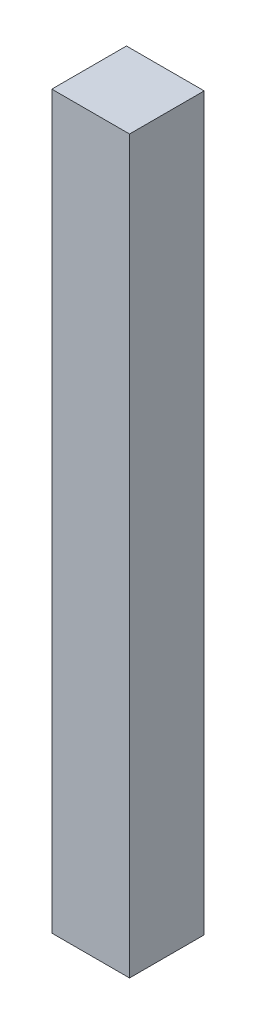
ISO-10303-21;
HEADER;
FILE_DESCRIPTION(('STEP AP214'),'2;1');
FILE_NAME('part.step','',(''),(''),'','','');
FILE_SCHEMA(('AUTOMOTIVE_DESIGN { 1 0 10303 214 1 1 1 1 }'));
ENDSEC;
DATA;
#1=APPLICATION_CONTEXT('core data for automotive mechanical design processes');
#2=APPLICATION_PROTOCOL_DEFINITION('international standard','automotive_design',2000,#1);
#3=PRODUCT_CONTEXT('',#1,'mechanical');
#4=PRODUCT('Part','Part','',(#3));
#5=PRODUCT_RELATED_PRODUCT_CATEGORY('part','',(#4));
#6=PRODUCT_DEFINITION_FORMATION('','',#4);
#7=PRODUCT_DEFINITION_CONTEXT('part definition',#1,'design');
#8=PRODUCT_DEFINITION('design','',#6,#7);
#9=PRODUCT_DEFINITION_SHAPE('','',#8);
#10=(LENGTH_UNIT() NAMED_UNIT(*) SI_UNIT(.MILLI.,.METRE.));
#11=(NAMED_UNIT(*) PLANE_ANGLE_UNIT() SI_UNIT($,.RADIAN.));
#12=(NAMED_UNIT(*) SI_UNIT($,.STERADIAN.) SOLID_ANGLE_UNIT());
#13=UNCERTAINTY_MEASURE_WITH_UNIT(LENGTH_MEASURE(1.E-05),#10,'distance_accuracy_value','');
#14=(GEOMETRIC_REPRESENTATION_CONTEXT(3) GLOBAL_UNCERTAINTY_ASSIGNED_CONTEXT((#13)) GLOBAL_UNIT_ASSIGNED_CONTEXT((#10,
#11,#12)) REPRESENTATION_CONTEXT('',''));
#15=CARTESIAN_POINT('',(0.,0.,0.));
#16=DIRECTION('',(0.,0.,1.));
#17=DIRECTION('',(1.,0.,0.));
#18=AXIS2_PLACEMENT_3D('',#15,#16,#17);
#19=CARTESIAN_POINT('',(0.122024776809807,0.,-0.1));
#20=DIRECTION('',(0.,0.,-1.));
#21=DIRECTION('',(-1.,0.,0.));
#22=AXIS2_PLACEMENT_3D('',#19,#20,#21);
#23=PLANE('',#22);
#24=DIRECTION('',(-1.,0.,0.));
#25=VECTOR('',#24,1.);
#26=CARTESIAN_POINT('',(0.174183230135963,-0.490474465927459,-0.1));
#27=LINE('',#26,#25);
#28=CARTESIAN_POINT('',(0.174183230135963,-0.490474465927459,-0.1));
#29=VERTEX_POINT('',#28);
#30=CARTESIAN_POINT('',(0.0698663234836505,-0.490474465927459,-0.1));
#31=VERTEX_POINT('',#30);
#32=EDGE_CURVE('E11',#29,#31,#27,.T.);
#33=ORIENTED_EDGE('',*,*,#32,.T.);
#34=DIRECTION('',(0.,1.,0.));
#35=VECTOR('',#34,1.);
#36=CARTESIAN_POINT('',(0.0698663234836505,-0.490474465927459,-0.1));
#37=LINE('',#36,#35);
#38=CARTESIAN_POINT('',(0.0698663234836506,0.490474465927459,-0.1));
#39=VERTEX_POINT('',#38);
#40=EDGE_CURVE('E86',#31,#39,#37,.T.);
#41=ORIENTED_EDGE('',*,*,#40,.T.);
#42=DIRECTION('',(1.,0.,0.));
#43=VECTOR('',#42,1.);
#44=CARTESIAN_POINT('',(0.0698663234836506,0.490474465927459,-0.1));
#45=LINE('',#44,#43);
#46=CARTESIAN_POINT('',(0.174183230135963,0.490474465927459,-0.1));
#47=VERTEX_POINT('',#46);
#48=EDGE_CURVE('E81',#39,#47,#45,.T.);
#49=ORIENTED_EDGE('',*,*,#48,.T.);
#50=DIRECTION('',(0.,-1.,0.));
#51=VECTOR('',#50,1.);
#52=CARTESIAN_POINT('',(0.174183230135963,0.490474465927459,-0.1));
#53=LINE('',#52,#51);
#54=EDGE_CURVE('E62',#47,#29,#53,.T.);
#55=ORIENTED_EDGE('',*,*,#54,.T.);
#56=EDGE_LOOP('',(#33,#41,#49,#55));
#57=FACE_BOUND('',#56,.T.);
#58=ADVANCED_FACE('F17',(#57),#23,.T.);
#59=CARTESIAN_POINT('',(0.0698663234836506,0.490474465927459,0.));
#60=DIRECTION('',(-1.,0.,0.));
#61=DIRECTION('',(0.,-1.,0.));
#62=AXIS2_PLACEMENT_3D('',#59,#60,#61);
#63=PLANE('',#62);
#64=DIRECTION('',(0.,0.,-1.));
#65=VECTOR('',#64,1.);
#66=CARTESIAN_POINT('',(0.0698663234836505,-0.490474465927459,0.0002));
#67=LINE('',#66,#65);
#68=CARTESIAN_POINT('',(0.0698663234836505,-0.490474465927459,0.0002));
#69=VERTEX_POINT('',#68);
#70=EDGE_CURVE('E24',#69,#31,#67,.T.);
#71=ORIENTED_EDGE('',*,*,#70,.F.);
#72=DIRECTION('',(0.,-1.,0.));
#73=VECTOR('',#72,1.);
#74=CARTESIAN_POINT('',(0.0698663234836506,0.490474465927459,0.0002));
#75=LINE('',#74,#73);
#76=CARTESIAN_POINT('',(0.0698663234836506,0.490474465927459,0.0002));
#77=VERTEX_POINT('',#76);
#78=EDGE_CURVE('E74',#77,#69,#75,.T.);
#79=ORIENTED_EDGE('',*,*,#78,.F.);
#80=DIRECTION('',(0.,0.,1.));
#81=VECTOR('',#80,1.);
#82=CARTESIAN_POINT('',(0.0698663234836506,0.490474465927459,-0.1));
#83=LINE('',#82,#81);
#84=EDGE_CURVE('E84',#39,#77,#83,.T.);
#85=ORIENTED_EDGE('',*,*,#84,.F.);
#86=ORIENTED_EDGE('',*,*,#40,.F.);
#87=EDGE_LOOP('',(#71,#79,#85,#86));
#88=FACE_BOUND('',#87,.T.);
#89=ADVANCED_FACE('F89',(#88),#63,.T.);
#90=CARTESIAN_POINT('',(0.174183230135963,0.490474465927459,0.));
#91=DIRECTION('',(0.,1.,0.));
#92=DIRECTION('',(-1.,0.,0.));
#93=AXIS2_PLACEMENT_3D('',#90,#91,#92);
#94=PLANE('',#93);
#95=ORIENTED_EDGE('',*,*,#84,.T.);
#96=DIRECTION('',(-1.,0.,0.));
#97=VECTOR('',#96,1.);
#98=CARTESIAN_POINT('',(0.174183230135963,0.490474465927459,0.0002));
#99=LINE('',#98,#97);
#100=CARTESIAN_POINT('',(0.174183230135963,0.490474465927459,0.0002));
#101=VERTEX_POINT('',#100);
#102=EDGE_CURVE('E78',#101,#77,#99,.T.);
#103=ORIENTED_EDGE('',*,*,#102,.F.);
#104=DIRECTION('',(0.,0.,1.));
#105=VECTOR('',#104,1.);
#106=CARTESIAN_POINT('',(0.174183230135963,0.490474465927459,-0.1));
#107=LINE('',#106,#105);
#108=EDGE_CURVE('E68',#47,#101,#107,.T.);
#109=ORIENTED_EDGE('',*,*,#108,.F.);
#110=ORIENTED_EDGE('',*,*,#48,.F.);
#111=EDGE_LOOP('',(#95,#103,#109,#110));
#112=FACE_BOUND('',#111,.T.);
#113=ADVANCED_FACE('F91',(#112),#94,.T.);
#114=CARTESIAN_POINT('',(0.174183230135963,-0.490474465927459,0.));
#115=DIRECTION('',(1.,0.,0.));
#116=DIRECTION('',(0.,1.,0.));
#117=AXIS2_PLACEMENT_3D('',#114,#115,#116);
#118=PLANE('',#117);
#119=ORIENTED_EDGE('',*,*,#108,.T.);
#120=DIRECTION('',(0.,1.,0.));
#121=VECTOR('',#120,1.);
#122=CARTESIAN_POINT('',(0.174183230135963,-0.490474465927459,0.0002));
#123=LINE('',#122,#121);
#124=CARTESIAN_POINT('',(0.174183230135963,-0.490474465927459,0.0002));
#125=VERTEX_POINT('',#124);
#126=EDGE_CURVE('E63',#125,#101,#123,.T.);
#127=ORIENTED_EDGE('',*,*,#126,.F.);
#128=DIRECTION('',(0.,0.,1.));
#129=VECTOR('',#128,1.);
#130=CARTESIAN_POINT('',(0.174183230135963,-0.490474465927459,-0.1));
#131=LINE('',#130,#129);
#132=EDGE_CURVE('E54',#29,#125,#131,.T.);
#133=ORIENTED_EDGE('',*,*,#132,.F.);
#134=ORIENTED_EDGE('',*,*,#54,.F.);
#135=EDGE_LOOP('',(#119,#127,#133,#134));
#136=FACE_BOUND('',#135,.T.);
#137=ADVANCED_FACE('F66',(#136),#118,.T.);
#138=CARTESIAN_POINT('',(0.0698663234836505,-0.490474465927459,0.));
#139=DIRECTION('',(0.,-1.,0.));
#140=DIRECTION('',(1.,0.,0.));
#141=AXIS2_PLACEMENT_3D('',#138,#139,#140);
#142=PLANE('',#141);
#143=ORIENTED_EDGE('',*,*,#132,.T.);
#144=DIRECTION('',(1.,0.,0.));
#145=VECTOR('',#144,1.);
#146=CARTESIAN_POINT('',(0.0698663234836505,-0.490474465927459,0.0002));
#147=LINE('',#146,#145);
#148=EDGE_CURVE('E58',#69,#125,#147,.T.);
#149=ORIENTED_EDGE('',*,*,#148,.F.);
#150=ORIENTED_EDGE('',*,*,#70,.T.);
#151=ORIENTED_EDGE('',*,*,#32,.F.);
#152=EDGE_LOOP('',(#143,#149,#150,#151));
#153=FACE_BOUND('',#152,.T.);
#154=ADVANCED_FACE('F56',(#153),#142,.T.);
#155=CARTESIAN_POINT('',(0.122024776809807,0.,0.0002));
#156=DIRECTION('',(0.,0.,1.));
#157=DIRECTION('',(1.,0.,0.));
#158=AXIS2_PLACEMENT_3D('',#155,#156,#157);
#159=PLANE('',#158);
#160=ORIENTED_EDGE('',*,*,#148,.T.);
#161=ORIENTED_EDGE('',*,*,#126,.T.);
#162=ORIENTED_EDGE('',*,*,#102,.T.);
#163=ORIENTED_EDGE('',*,*,#78,.T.);
#164=EDGE_LOOP('',(#160,#161,#162,#163));
#165=FACE_BOUND('',#164,.T.);
#166=ADVANCED_FACE('F73',(#165),#159,.T.);
#167=CLOSED_SHELL('',(#58,#89,#113,#137,#154,#166));
#168=MANIFOLD_SOLID_BREP('B1',#167);
#169=ADVANCED_BREP_SHAPE_REPRESENTATION('',(#18,#168),#14);
#170=SHAPE_DEFINITION_REPRESENTATION(#9,#169);
ENDSEC;
END-ISO-10303-21;
